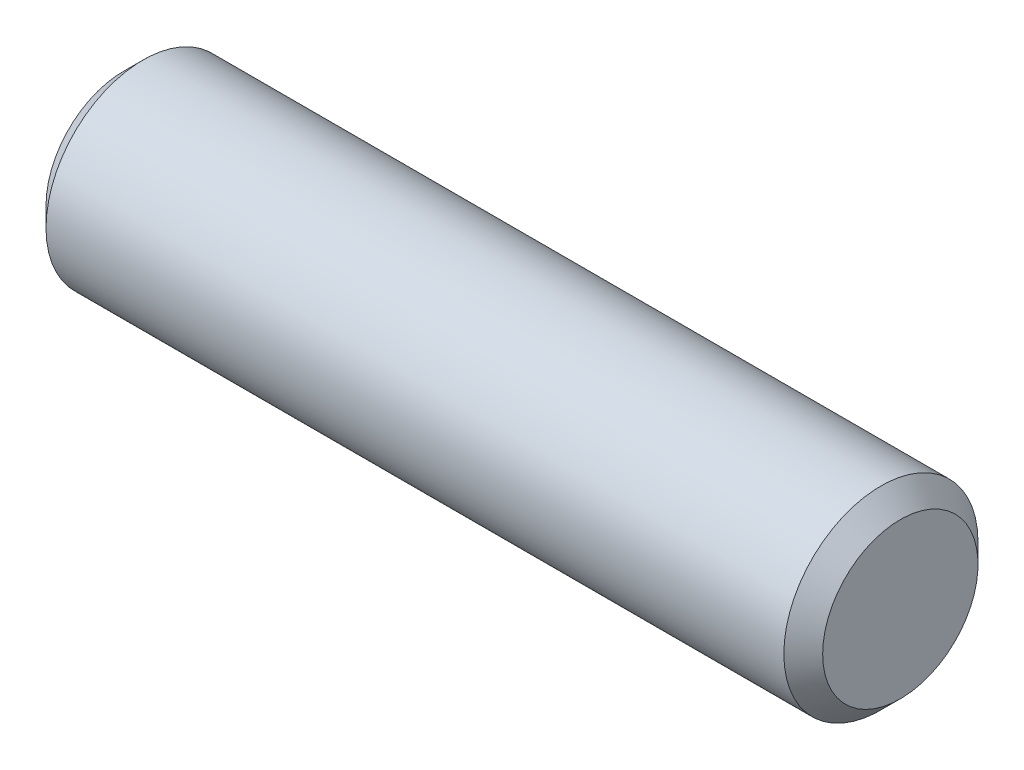
ISO-10303-21;
HEADER;
FILE_DESCRIPTION(('STEP AP214'),'2;1');
FILE_NAME('part.step','',(''),(''),'','','');
FILE_SCHEMA(('AUTOMOTIVE_DESIGN { 1 0 10303 214 1 1 1 1 }'));
ENDSEC;
DATA;
#1=APPLICATION_CONTEXT('core data for automotive mechanical design processes');
#2=APPLICATION_PROTOCOL_DEFINITION('international standard','automotive_design',2000,#1);
#3=PRODUCT_CONTEXT('',#1,'mechanical');
#4=PRODUCT('Part','Part','',(#3));
#5=PRODUCT_RELATED_PRODUCT_CATEGORY('part','',(#4));
#6=PRODUCT_DEFINITION_FORMATION('','',#4);
#7=PRODUCT_DEFINITION_CONTEXT('part definition',#1,'design');
#8=PRODUCT_DEFINITION('design','',#6,#7);
#9=PRODUCT_DEFINITION_SHAPE('','',#8);
#10=(LENGTH_UNIT() NAMED_UNIT(*) SI_UNIT(.MILLI.,.METRE.));
#11=(NAMED_UNIT(*) PLANE_ANGLE_UNIT() SI_UNIT($,.RADIAN.));
#12=(NAMED_UNIT(*) SI_UNIT($,.STERADIAN.) SOLID_ANGLE_UNIT());
#13=UNCERTAINTY_MEASURE_WITH_UNIT(LENGTH_MEASURE(1.E-05),#10,'distance_accuracy_value','');
#14=(GEOMETRIC_REPRESENTATION_CONTEXT(3) GLOBAL_UNCERTAINTY_ASSIGNED_CONTEXT((#13)) GLOBAL_UNIT_ASSIGNED_CONTEXT((#10,
#11,#12)) REPRESENTATION_CONTEXT('',''));
#15=CARTESIAN_POINT('',(0.,0.,0.));
#16=DIRECTION('',(0.,0.,1.));
#17=DIRECTION('',(1.,0.,0.));
#18=AXIS2_PLACEMENT_3D('',#15,#16,#17);
#19=CARTESIAN_POINT('',(-3.175,0.,0.));
#20=DIRECTION('',(1.,0.,0.));
#21=DIRECTION('',(0.,0.,1.));
#22=AXIS2_PLACEMENT_3D('',#19,#20,#21);
#23=CYLINDRICAL_SURFACE('',#22,0.79375);
#24=CARTESIAN_POINT('',(3.01625,0.,0.));
#25=DIRECTION('',(-1.,0.,0.));
#26=DIRECTION('',(0.,0.,1.));
#27=AXIS2_PLACEMENT_3D('',#24,#25,#26);
#28=CIRCLE('',#27,0.79375);
#29=CARTESIAN_POINT('',(3.01625,0.,0.79375));
#30=VERTEX_POINT('',#29);
#31=EDGE_CURVE('E37',#30,#30,#28,.F.);
#32=ORIENTED_EDGE('',*,*,#31,.F.);
#33=EDGE_LOOP('',(#32));
#34=FACE_BOUND('',#33,.T.);
#35=CARTESIAN_POINT('',(-3.01625,0.,0.));
#36=DIRECTION('',(-1.,0.,0.));
#37=DIRECTION('',(0.,0.,1.));
#38=AXIS2_PLACEMENT_3D('',#35,#36,#37);
#39=CIRCLE('',#38,0.79375);
#40=CARTESIAN_POINT('',(-3.01625,0.,0.79375));
#41=VERTEX_POINT('',#40);
#42=EDGE_CURVE('E41',#41,#41,#39,.T.);
#43=ORIENTED_EDGE('',*,*,#42,.F.);
#44=EDGE_LOOP('',(#43));
#45=FACE_BOUND('',#44,.T.);
#46=ADVANCED_FACE('F30',(#34,#45),#23,.T.);
#47=CARTESIAN_POINT('',(-3.175,0.,0.));
#48=DIRECTION('',(1.,0.,0.));
#49=DIRECTION('',(0.,0.,1.));
#50=AXIS2_PLACEMENT_3D('',#47,#48,#49);
#51=PLANE('',#50);
#52=CARTESIAN_POINT('',(-3.175,0.,0.));
#53=DIRECTION('',(-1.,0.,0.));
#54=DIRECTION('',(0.,0.,1.));
#55=AXIS2_PLACEMENT_3D('',#52,#53,#54);
#56=CIRCLE('',#55,0.635);
#57=CARTESIAN_POINT('',(-3.175,0.,0.635));
#58=VERTEX_POINT('',#57);
#59=EDGE_CURVE('E10',#58,#58,#56,.F.);
#60=ORIENTED_EDGE('',*,*,#59,.F.);
#61=EDGE_LOOP('',(#60));
#62=FACE_BOUND('',#61,.T.);
#63=ADVANCED_FACE('F55',(#62),#51,.F.);
#64=CARTESIAN_POINT('',(3.175,0.,0.));
#65=DIRECTION('',(1.,0.,0.));
#66=DIRECTION('',(0.,0.,1.));
#67=AXIS2_PLACEMENT_3D('',#64,#65,#66);
#68=PLANE('',#67);
#69=CARTESIAN_POINT('',(3.175,0.,0.));
#70=DIRECTION('',(-1.,0.,0.));
#71=DIRECTION('',(0.,0.,1.));
#72=AXIS2_PLACEMENT_3D('',#69,#70,#71);
#73=CIRCLE('',#72,0.635);
#74=CARTESIAN_POINT('',(3.175,0.,0.635));
#75=VERTEX_POINT('',#74);
#76=EDGE_CURVE('E45',#75,#75,#73,.T.);
#77=ORIENTED_EDGE('',*,*,#76,.F.);
#78=EDGE_LOOP('',(#77));
#79=FACE_BOUND('',#78,.T.);
#80=ADVANCED_FACE('F53',(#79),#68,.T.);
#81=CARTESIAN_POINT('',(3.175,0.,0.));
#82=DIRECTION('',(-1.,0.,0.));
#83=DIRECTION('',(0.,0.,-1.));
#84=AXIS2_PLACEMENT_3D('',#81,#82,#83);
#85=CONICAL_SURFACE('',#84,0.635,0.785398163397445);
#86=ORIENTED_EDGE('',*,*,#31,.T.);
#87=EDGE_LOOP('',(#86));
#88=FACE_BOUND('',#87,.T.);
#89=ORIENTED_EDGE('',*,*,#76,.T.);
#90=EDGE_LOOP('',(#89));
#91=FACE_BOUND('',#90,.T.);
#92=ADVANCED_FACE('F51',(#88,#91),#85,.T.);
#93=CARTESIAN_POINT('',(-3.01625,0.,0.));
#94=DIRECTION('',(1.,0.,0.));
#95=DIRECTION('',(0.,0.,1.));
#96=AXIS2_PLACEMENT_3D('',#93,#94,#95);
#97=CONICAL_SURFACE('',#96,0.79375,0.785398163397448);
#98=ORIENTED_EDGE('',*,*,#59,.T.);
#99=EDGE_LOOP('',(#98));
#100=FACE_BOUND('',#99,.T.);
#101=ORIENTED_EDGE('',*,*,#42,.T.);
#102=EDGE_LOOP('',(#101));
#103=FACE_BOUND('',#102,.T.);
#104=ADVANCED_FACE('F32',(#100,#103),#97,.T.);
#105=CLOSED_SHELL('',(#46,#63,#80,#92,#104));
#106=MANIFOLD_SOLID_BREP('B2',#105);
#107=ADVANCED_BREP_SHAPE_REPRESENTATION('',(#18,#106),#14);
#108=SHAPE_DEFINITION_REPRESENTATION(#9,#107);
ENDSEC;
END-ISO-10303-21;
